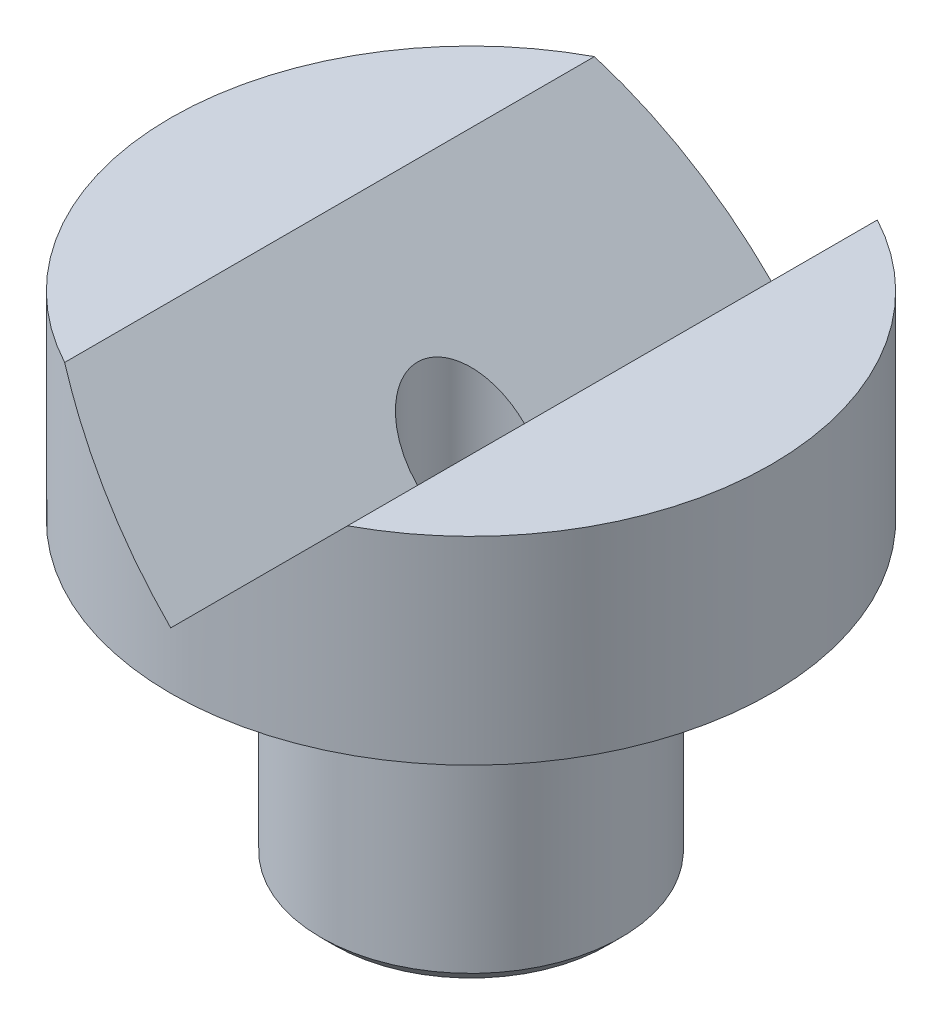
ISO-10303-21;
HEADER;
FILE_DESCRIPTION(('STEP AP214'),'2;1');
FILE_NAME('part.step','',(''),(''),'','','');
FILE_SCHEMA(('AUTOMOTIVE_DESIGN { 1 0 10303 214 1 1 1 1 }'));
ENDSEC;
DATA;
#1=APPLICATION_CONTEXT('core data for automotive mechanical design processes');
#2=APPLICATION_PROTOCOL_DEFINITION('international standard','automotive_design',2000,#1);
#3=PRODUCT_CONTEXT('',#1,'mechanical');
#4=PRODUCT('Part','Part','',(#3));
#5=PRODUCT_RELATED_PRODUCT_CATEGORY('part','',(#4));
#6=PRODUCT_DEFINITION_FORMATION('','',#4);
#7=PRODUCT_DEFINITION_CONTEXT('part definition',#1,'design');
#8=PRODUCT_DEFINITION('design','',#6,#7);
#9=PRODUCT_DEFINITION_SHAPE('','',#8);
#10=(LENGTH_UNIT() NAMED_UNIT(*) SI_UNIT(.MILLI.,.METRE.));
#11=(NAMED_UNIT(*) PLANE_ANGLE_UNIT() SI_UNIT($,.RADIAN.));
#12=(NAMED_UNIT(*) SI_UNIT($,.STERADIAN.) SOLID_ANGLE_UNIT());
#13=UNCERTAINTY_MEASURE_WITH_UNIT(LENGTH_MEASURE(1.E-05),#10,'distance_accuracy_value','');
#14=(GEOMETRIC_REPRESENTATION_CONTEXT(3) GLOBAL_UNCERTAINTY_ASSIGNED_CONTEXT((#13)) GLOBAL_UNIT_ASSIGNED_CONTEXT((#10,
#11,#12)) REPRESENTATION_CONTEXT('',''));
#15=CARTESIAN_POINT('',(0.,0.,0.));
#16=DIRECTION('',(0.,0.,1.));
#17=DIRECTION('',(1.,0.,0.));
#18=AXIS2_PLACEMENT_3D('',#15,#16,#17);
#19=CARTESIAN_POINT('',(3.175,-6.35,0.));
#20=DIRECTION('',(0.,1.,0.));
#21=DIRECTION('',(0.,0.,1.));
#22=AXIS2_PLACEMENT_3D('',#19,#20,#21);
#23=PLANE('',#22);
#24=CARTESIAN_POINT('',(0.,-6.35,0.));
#25=DIRECTION('',(0.,1.,0.));
#26=DIRECTION('',(0.,0.,1.));
#27=AXIS2_PLACEMENT_3D('',#24,#25,#26);
#28=CIRCLE('',#27,2.8829);
#29=CARTESIAN_POINT('',(0.,-6.35,2.8829));
#30=VERTEX_POINT('',#29);
#31=EDGE_CURVE('E43',#30,#30,#28,.F.);
#32=ORIENTED_EDGE('',*,*,#31,.T.);
#33=EDGE_LOOP('',(#32));
#34=FACE_BOUND('',#33,.T.);
#35=CARTESIAN_POINT('',(0.,-6.35,0.));
#36=DIRECTION('',(0.,1.,0.));
#37=DIRECTION('',(0.,0.,1.));
#38=AXIS2_PLACEMENT_3D('',#35,#36,#37);
#39=CIRCLE('',#38,1.4224);
#40=CARTESIAN_POINT('',(0.,-6.35,1.4224));
#41=VERTEX_POINT('',#40);
#42=EDGE_CURVE('E113',#41,#41,#39,.T.);
#43=ORIENTED_EDGE('',*,*,#42,.T.);
#44=EDGE_LOOP('',(#43));
#45=FACE_BOUND('',#44,.T.);
#46=ADVANCED_FACE('F35',(#34,#45),#23,.F.);
#47=CARTESIAN_POINT('',(0.,1.19947193946542,-6.35));
#48=DIRECTION('',(-0.707106781186547,-0.707106781186548,0.));
#49=DIRECTION('',(0.707106781186548,-0.707106781186547,0.));
#50=AXIS2_PLACEMENT_3D('',#47,#48,#49);
#51=PLANE('',#50);
#52=CARTESIAN_POINT('',(0.,1.19947193946542,0.));
#53=DIRECTION('',(-0.707106781186547,-0.707106781186548,0.));
#54=DIRECTION('',(-0.707106781186548,0.707106781186547,0.));
#55=AXIS2_PLACEMENT_3D('',#52,#53,#54);
#56=ELLIPSE('',#55,1.59848558955031,1.1303);
#57=CARTESIAN_POINT('',(0.,1.19947193946542,-1.1303));
#58=VERTEX_POINT('',#57);
#59=CARTESIAN_POINT('',(0.,1.19947193946542,1.1303));
#60=VERTEX_POINT('',#59);
#61=EDGE_CURVE('E49',#58,#60,#56,.F.);
#62=ORIENTED_EDGE('',*,*,#61,.F.);
#63=DIRECTION('',(0.,0.,1.));
#64=VECTOR('',#63,1.);
#65=CARTESIAN_POINT('',(0.,1.19947193946542,-6.35));
#66=LINE('',#65,#64);
#67=CARTESIAN_POINT('',(0.,1.19947193946542,-6.35));
#68=VERTEX_POINT('',#67);
#69=EDGE_CURVE('E83',#68,#58,#66,.T.);
#70=ORIENTED_EDGE('',*,*,#69,.F.);
#71=CARTESIAN_POINT('',(0.,1.19947193946542,0.));
#72=DIRECTION('',(-0.707106781186547,-0.707106781186548,0.));
#73=DIRECTION('',(-0.707106781186548,0.707106781186547,0.));
#74=AXIS2_PLACEMENT_3D('',#71,#72,#73);
#75=ELLIPSE('',#74,8.98025612106915,6.35);
#76=CARTESIAN_POINT('',(-2.99152806053458,4.191,-5.60118379122077));
#77=VERTEX_POINT('',#76);
#78=EDGE_CURVE('E99',#77,#68,#75,.T.);
#79=ORIENTED_EDGE('',*,*,#78,.F.);
#80=DIRECTION('',(0.,0.,-1.));
#81=VECTOR('',#80,1.);
#82=CARTESIAN_POINT('',(-2.99152806053458,4.191,0.));
#83=LINE('',#82,#81);
#84=CARTESIAN_POINT('',(-2.99152806053458,4.191,5.60118379122077));
#85=VERTEX_POINT('',#84);
#86=EDGE_CURVE('E78',#85,#77,#83,.T.);
#87=ORIENTED_EDGE('',*,*,#86,.F.);
#88=CARTESIAN_POINT('',(0.,1.19947193946542,6.35));
#89=VERTEX_POINT('',#88);
#90=EDGE_CURVE('E96',#89,#85,#75,.T.);
#91=ORIENTED_EDGE('',*,*,#90,.F.);
#92=EDGE_CURVE('E86',#60,#89,#66,.T.);
#93=ORIENTED_EDGE('',*,*,#92,.F.);
#94=EDGE_LOOP('',(#62,#70,#79,#87,#91,#93));
#95=FACE_BOUND('',#94,.T.);
#96=ADVANCED_FACE('F82',(#95),#51,.F.);
#97=CARTESIAN_POINT('',(2.99152806053458,4.191,-6.35));
#98=DIRECTION('',(0.707106781186547,-0.707106781186548,0.));
#99=DIRECTION('',(0.707106781186548,0.707106781186547,0.));
#100=AXIS2_PLACEMENT_3D('',#97,#98,#99);
#101=PLANE('',#100);
#102=CARTESIAN_POINT('',(0.,1.19947193946542,0.));
#103=DIRECTION('',(0.707106781186547,-0.707106781186548,0.));
#104=DIRECTION('',(0.707106781186548,0.707106781186547,0.));
#105=AXIS2_PLACEMENT_3D('',#102,#103,#104);
#106=ELLIPSE('',#105,1.59848558955031,1.1303);
#107=EDGE_CURVE('E73',#60,#58,#106,.F.);
#108=ORIENTED_EDGE('',*,*,#107,.F.);
#109=ORIENTED_EDGE('',*,*,#92,.T.);
#110=CARTESIAN_POINT('',(0.,1.19947193946542,0.));
#111=DIRECTION('',(0.707106781186547,-0.707106781186548,0.));
#112=DIRECTION('',(0.707106781186548,0.707106781186547,0.));
#113=AXIS2_PLACEMENT_3D('',#110,#111,#112);
#114=ELLIPSE('',#113,8.98025612106915,6.35);
#115=CARTESIAN_POINT('',(2.99152806053458,4.191,5.60118379122077));
#116=VERTEX_POINT('',#115);
#117=EDGE_CURVE('E57',#116,#89,#114,.T.);
#118=ORIENTED_EDGE('',*,*,#117,.F.);
#119=DIRECTION('',(0.,0.,1.));
#120=VECTOR('',#119,1.);
#121=CARTESIAN_POINT('',(2.99152806053458,4.191,0.));
#122=LINE('',#121,#120);
#123=CARTESIAN_POINT('',(2.99152806053458,4.191,-5.60118379122077));
#124=VERTEX_POINT('',#123);
#125=EDGE_CURVE('E107',#124,#116,#122,.T.);
#126=ORIENTED_EDGE('',*,*,#125,.F.);
#127=EDGE_CURVE('E91',#68,#124,#114,.T.);
#128=ORIENTED_EDGE('',*,*,#127,.F.);
#129=ORIENTED_EDGE('',*,*,#69,.T.);
#130=EDGE_LOOP('',(#108,#109,#118,#126,#128,#129));
#131=FACE_BOUND('',#130,.T.);
#132=ADVANCED_FACE('F89',(#131),#101,.F.);
#133=CARTESIAN_POINT('',(0.,4.191,0.));
#134=DIRECTION('',(0.,-1.,0.));
#135=DIRECTION('',(0.,0.,-1.));
#136=AXIS2_PLACEMENT_3D('',#133,#134,#135);
#137=PLANE('',#136);
#138=CARTESIAN_POINT('',(0.,4.191,0.));
#139=DIRECTION('',(0.,1.,0.));
#140=DIRECTION('',(0.,0.,1.));
#141=AXIS2_PLACEMENT_3D('',#138,#139,#140);
#142=CIRCLE('',#141,6.35);
#143=EDGE_CURVE('E100',#77,#85,#142,.T.);
#144=ORIENTED_EDGE('',*,*,#143,.T.);
#145=ORIENTED_EDGE('',*,*,#86,.T.);
#146=EDGE_LOOP('',(#144,#145));
#147=FACE_BOUND('',#146,.T.);
#148=ADVANCED_FACE('F128',(#147),#137,.F.);
#149=CARTESIAN_POINT('',(0.,6.43902326364059,0.));
#150=DIRECTION('',(0.,1.,0.));
#151=DIRECTION('',(0.,0.,1.));
#152=AXIS2_PLACEMENT_3D('',#149,#150,#151);
#153=CYLINDRICAL_SURFACE('',#152,3.175);
#154=CARTESIAN_POINT('',(0.,-0.735852293811325,0.));
#155=DIRECTION('',(0.,-1.,0.));
#156=DIRECTION('',(0.,0.,-1.));
#157=AXIS2_PLACEMENT_3D('',#154,#155,#156);
#158=CIRCLE('',#157,3.175);
#159=CARTESIAN_POINT('',(0.,-0.735852293811325,-3.175));
#160=VERTEX_POINT('',#159);
#161=EDGE_CURVE('E87',#160,#160,#158,.T.);
#162=ORIENTED_EDGE('',*,*,#161,.T.);
#163=EDGE_LOOP('',(#162));
#164=FACE_BOUND('',#163,.T.);
#165=CARTESIAN_POINT('',(0.,-6.0579,0.));
#166=DIRECTION('',(0.,1.,0.));
#167=DIRECTION('',(0.,0.,1.));
#168=AXIS2_PLACEMENT_3D('',#165,#166,#167);
#169=CIRCLE('',#168,3.175);
#170=CARTESIAN_POINT('',(0.,-6.0579,3.175));
#171=VERTEX_POINT('',#170);
#172=EDGE_CURVE('E77',#171,#171,#169,.T.);
#173=ORIENTED_EDGE('',*,*,#172,.T.);
#174=EDGE_LOOP('',(#173));
#175=FACE_BOUND('',#174,.T.);
#176=ADVANCED_FACE('F125',(#164,#175),#153,.T.);
#177=CARTESIAN_POINT('',(6.35,0.,0.));
#178=DIRECTION('',(0.,1.,0.));
#179=DIRECTION('',(0.,0.,1.));
#180=AXIS2_PLACEMENT_3D('',#177,#178,#179);
#181=PLANE('',#180);
#182=CARTESIAN_POINT('',(0.,0.,0.));
#183=DIRECTION('',(0.,-1.,0.));
#184=DIRECTION('',(0.,0.,-1.));
#185=AXIS2_PLACEMENT_3D('',#182,#183,#184);
#186=CIRCLE('',#185,3.91085229381132);
#187=CARTESIAN_POINT('',(0.,0.,-3.91085229381132));
#188=VERTEX_POINT('',#187);
#189=EDGE_CURVE('E243',#188,#188,#186,.T.);
#190=ORIENTED_EDGE('',*,*,#189,.F.);
#191=EDGE_LOOP('',(#190));
#192=FACE_BOUND('',#191,.T.);
#193=CARTESIAN_POINT('',(0.,0.,0.));
#194=DIRECTION('',(0.,1.,0.));
#195=DIRECTION('',(0.,0.,1.));
#196=AXIS2_PLACEMENT_3D('',#193,#194,#195);
#197=CIRCLE('',#196,6.35);
#198=CARTESIAN_POINT('',(0.,0.,6.35));
#199=VERTEX_POINT('',#198);
#200=EDGE_CURVE('E104',#199,#199,#197,.T.);
#201=ORIENTED_EDGE('',*,*,#200,.F.);
#202=EDGE_LOOP('',(#201));
#203=FACE_BOUND('',#202,.T.);
#204=ADVANCED_FACE('F127',(#192,#203),#181,.F.);
#205=CARTESIAN_POINT('',(0.,6.43902326364059,0.));
#206=DIRECTION('',(0.,1.,0.));
#207=DIRECTION('',(0.,0.,1.));
#208=AXIS2_PLACEMENT_3D('',#205,#206,#207);
#209=CYLINDRICAL_SURFACE('',#208,6.35);
#210=ORIENTED_EDGE('',*,*,#143,.F.);
#211=ORIENTED_EDGE('',*,*,#78,.T.);
#212=ORIENTED_EDGE('',*,*,#127,.T.);
#213=EDGE_CURVE('E103',#116,#124,#142,.T.);
#214=ORIENTED_EDGE('',*,*,#213,.F.);
#215=ORIENTED_EDGE('',*,*,#117,.T.);
#216=ORIENTED_EDGE('',*,*,#90,.T.);
#217=EDGE_LOOP('',(#210,#211,#212,#214,#215,#216));
#218=FACE_BOUND('',#217,.T.);
#219=ORIENTED_EDGE('',*,*,#200,.T.);
#220=EDGE_LOOP('',(#219));
#221=FACE_BOUND('',#220,.T.);
#222=ADVANCED_FACE('F135',(#218,#221),#209,.T.);
#223=ORIENTED_EDGE('',*,*,#213,.T.);
#224=ORIENTED_EDGE('',*,*,#125,.T.);
#225=EDGE_LOOP('',(#223,#224));
#226=FACE_BOUND('',#225,.T.);
#227=ADVANCED_FACE('F140',(#226),#137,.F.);
#228=CARTESIAN_POINT('',(0.,13.9793934911243,0.));
#229=DIRECTION('',(0.,1.,0.));
#230=DIRECTION('',(0.,0.,1.));
#231=AXIS2_PLACEMENT_3D('',#228,#229,#230);
#232=CYLINDRICAL_SURFACE('',#231,1.1303);
#233=CARTESIAN_POINT('',(0.,-6.0579,0.));
#234=DIRECTION('',(0.,1.,0.));
#235=DIRECTION('',(0.,0.,1.));
#236=AXIS2_PLACEMENT_3D('',#233,#234,#235);
#237=CIRCLE('',#236,1.1303);
#238=CARTESIAN_POINT('',(0.,-6.0579,1.1303));
#239=VERTEX_POINT('',#238);
#240=EDGE_CURVE('E11',#239,#239,#237,.F.);
#241=ORIENTED_EDGE('',*,*,#240,.T.);
#242=EDGE_LOOP('',(#241));
#243=FACE_BOUND('',#242,.T.);
#244=ORIENTED_EDGE('',*,*,#61,.T.);
#245=ORIENTED_EDGE('',*,*,#107,.T.);
#246=EDGE_LOOP('',(#244,#245));
#247=FACE_BOUND('',#246,.T.);
#248=ADVANCED_FACE('F74',(#243,#247),#232,.F.);
#249=CARTESIAN_POINT('',(0.,-6.0579,0.));
#250=DIRECTION('',(0.,1.,0.));
#251=DIRECTION('',(0.,0.,1.));
#252=AXIS2_PLACEMENT_3D('',#249,#250,#251);
#253=CONICAL_SURFACE('',#252,3.175,0.785398163397449);
#254=ORIENTED_EDGE('',*,*,#31,.F.);
#255=EDGE_LOOP('',(#254));
#256=FACE_BOUND('',#255,.T.);
#257=ORIENTED_EDGE('',*,*,#172,.F.);
#258=EDGE_LOOP('',(#257));
#259=FACE_BOUND('',#258,.T.);
#260=ADVANCED_FACE('F120',(#256,#259),#253,.T.);
#261=CARTESIAN_POINT('',(0.,-6.35,0.));
#262=DIRECTION('',(0.,-1.,0.));
#263=DIRECTION('',(0.,0.,-1.));
#264=AXIS2_PLACEMENT_3D('',#261,#262,#263);
#265=CONICAL_SURFACE('',#264,1.4224,0.78539816339744);
#266=ORIENTED_EDGE('',*,*,#240,.F.);
#267=EDGE_LOOP('',(#266));
#268=FACE_BOUND('',#267,.T.);
#269=ORIENTED_EDGE('',*,*,#42,.F.);
#270=EDGE_LOOP('',(#269));
#271=FACE_BOUND('',#270,.T.);
#272=ADVANCED_FACE('F37',(#268,#271),#265,.F.);
#273=CARTESIAN_POINT('',(0.,-0.367926146905662,0.));
#274=DIRECTION('',(0.,-1.,0.));
#275=DIRECTION('',(0.,0.,-1.));
#276=AXIS2_PLACEMENT_3D('',#273,#274,#275);
#277=TOROIDAL_SURFACE('',#276,3.54292614690566,0.520326146905663);
#278=ORIENTED_EDGE('',*,*,#189,.T.);
#279=EDGE_LOOP('',(#278));
#280=FACE_BOUND('',#279,.T.);
#281=ORIENTED_EDGE('',*,*,#161,.F.);
#282=EDGE_LOOP('',(#281));
#283=FACE_BOUND('',#282,.T.);
#284=ADVANCED_FACE('F189',(#280,#283),#277,.F.);
#285=CLOSED_SHELL('',(#46,#96,#132,#148,#176,#204,#222,#227,#248,#260,#272,#284));
#286=MANIFOLD_SOLID_BREP('B2',#285);
#287=ADVANCED_BREP_SHAPE_REPRESENTATION('',(#18,#286),#14);
#288=SHAPE_DEFINITION_REPRESENTATION(#9,#287);
ENDSEC;
END-ISO-10303-21;
